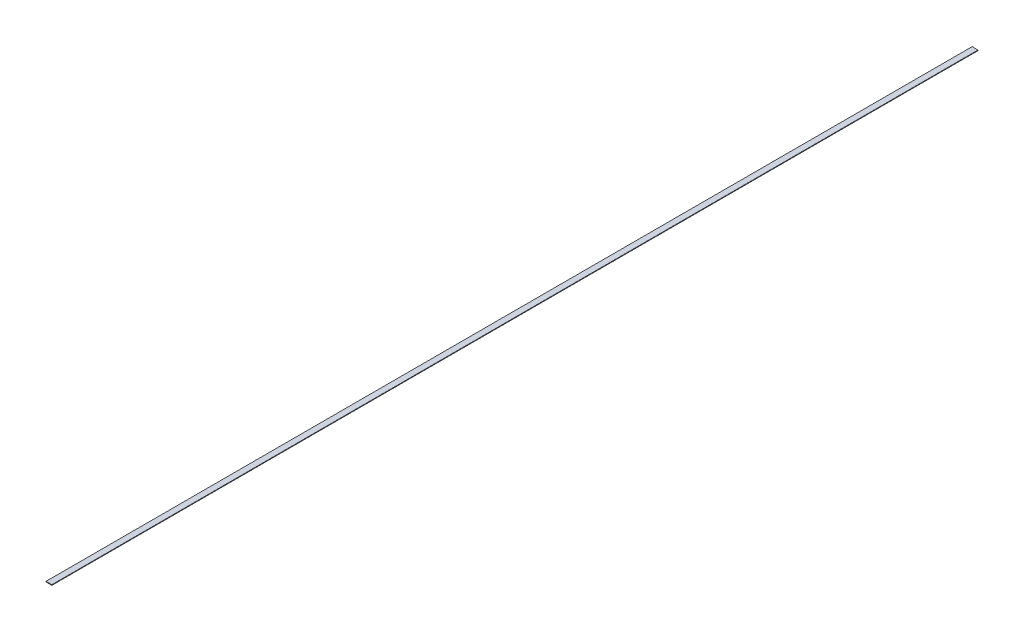
ISO-10303-21;
HEADER;
FILE_DESCRIPTION(('STEP AP214'),'2;1');
FILE_NAME('part.step','',(''),(''),'','','');
FILE_SCHEMA(('AUTOMOTIVE_DESIGN { 1 0 10303 214 1 1 1 1 }'));
ENDSEC;
DATA;
#1=APPLICATION_CONTEXT('core data for automotive mechanical design processes');
#2=APPLICATION_PROTOCOL_DEFINITION('international standard','automotive_design',2000,#1);
#3=PRODUCT_CONTEXT('',#1,'mechanical');
#4=PRODUCT('Part','Part','',(#3));
#5=PRODUCT_RELATED_PRODUCT_CATEGORY('part','',(#4));
#6=PRODUCT_DEFINITION_FORMATION('','',#4);
#7=PRODUCT_DEFINITION_CONTEXT('part definition',#1,'design');
#8=PRODUCT_DEFINITION('design','',#6,#7);
#9=PRODUCT_DEFINITION_SHAPE('','',#8);
#10=(LENGTH_UNIT() NAMED_UNIT(*) SI_UNIT(.MILLI.,.METRE.));
#11=(NAMED_UNIT(*) PLANE_ANGLE_UNIT() SI_UNIT($,.RADIAN.));
#12=(NAMED_UNIT(*) SI_UNIT($,.STERADIAN.) SOLID_ANGLE_UNIT());
#13=UNCERTAINTY_MEASURE_WITH_UNIT(LENGTH_MEASURE(1.E-05),#10,'distance_accuracy_value','');
#14=(GEOMETRIC_REPRESENTATION_CONTEXT(3) GLOBAL_UNCERTAINTY_ASSIGNED_CONTEXT((#13)) GLOBAL_UNIT_ASSIGNED_CONTEXT((#10,
#11,#12)) REPRESENTATION_CONTEXT('',''));
#15=CARTESIAN_POINT('',(0.,0.,0.));
#16=DIRECTION('',(0.,0.,1.));
#17=DIRECTION('',(1.,0.,0.));
#18=AXIS2_PLACEMENT_3D('',#15,#16,#17);
#19=CARTESIAN_POINT('',(0.,5.08,0.));
#20=DIRECTION('',(1.,0.,0.));
#21=DIRECTION('',(0.,0.,-1.));
#22=AXIS2_PLACEMENT_3D('',#19,#20,#21);
#23=PLANE('',#22);
#24=DIRECTION('',(0.,0.,1.));
#25=VECTOR('',#24,1.);
#26=CARTESIAN_POINT('',(0.,0.,0.));
#27=LINE('',#26,#25);
#28=CARTESIAN_POINT('',(0.,0.,-8051.8));
#29=VERTEX_POINT('',#28);
#30=CARTESIAN_POINT('',(0.,0.,0.));
#31=VERTEX_POINT('',#30);
#32=EDGE_CURVE('E100',#29,#31,#27,.T.);
#33=ORIENTED_EDGE('',*,*,#32,.T.);
#34=DIRECTION('',(0.,-1.,0.));
#35=VECTOR('',#34,1.);
#36=CARTESIAN_POINT('',(0.,5.08,0.));
#37=LINE('',#36,#35);
#38=CARTESIAN_POINT('',(0.,5.08,0.));
#39=VERTEX_POINT('',#38);
#40=EDGE_CURVE('E11',#39,#31,#37,.T.);
#41=ORIENTED_EDGE('',*,*,#40,.F.);
#42=DIRECTION('',(0.,0.,1.));
#43=VECTOR('',#42,1.);
#44=CARTESIAN_POINT('',(0.,5.08,0.));
#45=LINE('',#44,#43);
#46=CARTESIAN_POINT('',(0.,5.08,-8051.8));
#47=VERTEX_POINT('',#46);
#48=EDGE_CURVE('E88',#47,#39,#45,.T.);
#49=ORIENTED_EDGE('',*,*,#48,.F.);
#50=DIRECTION('',(0.,-1.,0.));
#51=VECTOR('',#50,1.);
#52=CARTESIAN_POINT('',(0.,5.08,-8051.8));
#53=LINE('',#52,#51);
#54=EDGE_CURVE('E96',#47,#29,#53,.T.);
#55=ORIENTED_EDGE('',*,*,#54,.T.);
#56=EDGE_LOOP('',(#33,#41,#49,#55));
#57=FACE_BOUND('',#56,.T.);
#58=ADVANCED_FACE('F37',(#57),#23,.F.);
#59=CARTESIAN_POINT('',(0.,5.08,0.));
#60=DIRECTION('',(0.,0.,-1.));
#61=DIRECTION('',(-1.,0.,0.));
#62=AXIS2_PLACEMENT_3D('',#59,#60,#61);
#63=PLANE('',#62);
#64=DIRECTION('',(1.,0.,0.));
#65=VECTOR('',#64,1.);
#66=CARTESIAN_POINT('',(0.,0.,0.));
#67=LINE('',#66,#65);
#68=CARTESIAN_POINT('',(50.8,0.,0.));
#69=VERTEX_POINT('',#68);
#70=EDGE_CURVE('E92',#31,#69,#67,.T.);
#71=ORIENTED_EDGE('',*,*,#70,.T.);
#72=DIRECTION('',(0.,-1.,0.));
#73=VECTOR('',#72,1.);
#74=CARTESIAN_POINT('',(50.8,5.08,0.));
#75=LINE('',#74,#73);
#76=CARTESIAN_POINT('',(50.8,5.08,0.));
#77=VERTEX_POINT('',#76);
#78=EDGE_CURVE('E45',#77,#69,#75,.T.);
#79=ORIENTED_EDGE('',*,*,#78,.F.);
#80=DIRECTION('',(1.,0.,0.));
#81=VECTOR('',#80,1.);
#82=CARTESIAN_POINT('',(0.,5.08,0.));
#83=LINE('',#82,#81);
#84=EDGE_CURVE('E83',#39,#77,#83,.T.);
#85=ORIENTED_EDGE('',*,*,#84,.F.);
#86=ORIENTED_EDGE('',*,*,#40,.T.);
#87=EDGE_LOOP('',(#71,#79,#85,#86));
#88=FACE_BOUND('',#87,.T.);
#89=ADVANCED_FACE('F91',(#88),#63,.F.);
#90=CARTESIAN_POINT('',(50.8,5.08,0.));
#91=DIRECTION('',(-1.,0.,0.));
#92=DIRECTION('',(0.,0.,1.));
#93=AXIS2_PLACEMENT_3D('',#90,#91,#92);
#94=PLANE('',#93);
#95=DIRECTION('',(0.,0.,-1.));
#96=VECTOR('',#95,1.);
#97=CARTESIAN_POINT('',(50.8,0.,0.));
#98=LINE('',#97,#96);
#99=CARTESIAN_POINT('',(50.8,0.,-8051.8));
#100=VERTEX_POINT('',#99);
#101=EDGE_CURVE('E70',#69,#100,#98,.T.);
#102=ORIENTED_EDGE('',*,*,#101,.T.);
#103=DIRECTION('',(0.,-1.,0.));
#104=VECTOR('',#103,1.);
#105=CARTESIAN_POINT('',(50.8,5.08,-8051.8));
#106=LINE('',#105,#104);
#107=CARTESIAN_POINT('',(50.8,5.08,-8051.8));
#108=VERTEX_POINT('',#107);
#109=EDGE_CURVE('E93',#108,#100,#106,.T.);
#110=ORIENTED_EDGE('',*,*,#109,.F.);
#111=DIRECTION('',(0.,0.,-1.));
#112=VECTOR('',#111,1.);
#113=CARTESIAN_POINT('',(50.8,5.08,0.));
#114=LINE('',#113,#112);
#115=EDGE_CURVE('E86',#77,#108,#114,.T.);
#116=ORIENTED_EDGE('',*,*,#115,.F.);
#117=ORIENTED_EDGE('',*,*,#78,.T.);
#118=EDGE_LOOP('',(#102,#110,#116,#117));
#119=FACE_BOUND('',#118,.T.);
#120=ADVANCED_FACE('F94',(#119),#94,.F.);
#121=CARTESIAN_POINT('',(0.,5.08,-8051.8));
#122=DIRECTION('',(0.,0.,1.));
#123=DIRECTION('',(1.,0.,0.));
#124=AXIS2_PLACEMENT_3D('',#121,#122,#123);
#125=PLANE('',#124);
#126=DIRECTION('',(-1.,0.,0.));
#127=VECTOR('',#126,1.);
#128=CARTESIAN_POINT('',(0.,0.,-8051.8));
#129=LINE('',#128,#127);
#130=EDGE_CURVE('E76',#100,#29,#129,.T.);
#131=ORIENTED_EDGE('',*,*,#130,.T.);
#132=ORIENTED_EDGE('',*,*,#54,.F.);
#133=DIRECTION('',(-1.,0.,0.));
#134=VECTOR('',#133,1.);
#135=CARTESIAN_POINT('',(0.,5.08,-8051.8));
#136=LINE('',#135,#134);
#137=EDGE_CURVE('E53',#108,#47,#136,.T.);
#138=ORIENTED_EDGE('',*,*,#137,.F.);
#139=ORIENTED_EDGE('',*,*,#109,.T.);
#140=EDGE_LOOP('',(#131,#132,#138,#139));
#141=FACE_BOUND('',#140,.T.);
#142=ADVANCED_FACE('F107',(#141),#125,.F.);
#143=CARTESIAN_POINT('',(0.,5.08,0.));
#144=DIRECTION('',(0.,-1.,0.));
#145=DIRECTION('',(0.,0.,-1.));
#146=AXIS2_PLACEMENT_3D('',#143,#144,#145);
#147=PLANE('',#146);
#148=ORIENTED_EDGE('',*,*,#48,.T.);
#149=ORIENTED_EDGE('',*,*,#84,.T.);
#150=ORIENTED_EDGE('',*,*,#115,.T.);
#151=ORIENTED_EDGE('',*,*,#137,.T.);
#152=EDGE_LOOP('',(#148,#149,#150,#151));
#153=FACE_BOUND('',#152,.T.);
#154=ADVANCED_FACE('F84',(#153),#147,.F.);
#155=CARTESIAN_POINT('',(0.,0.,0.));
#156=DIRECTION('',(0.,-1.,0.));
#157=DIRECTION('',(0.,0.,-1.));
#158=AXIS2_PLACEMENT_3D('',#155,#156,#157);
#159=PLANE('',#158);
#160=ORIENTED_EDGE('',*,*,#32,.F.);
#161=ORIENTED_EDGE('',*,*,#130,.F.);
#162=ORIENTED_EDGE('',*,*,#101,.F.);
#163=ORIENTED_EDGE('',*,*,#70,.F.);
#164=EDGE_LOOP('',(#160,#161,#162,#163));
#165=FACE_BOUND('',#164,.T.);
#166=ADVANCED_FACE('F110',(#165),#159,.T.);
#167=CLOSED_SHELL('',(#58,#89,#120,#142,#154,#166));
#168=MANIFOLD_SOLID_BREP('B2',#167);
#169=ADVANCED_BREP_SHAPE_REPRESENTATION('',(#18,#168),#14);
#170=SHAPE_DEFINITION_REPRESENTATION(#9,#169);
ENDSEC;
END-ISO-10303-21;
